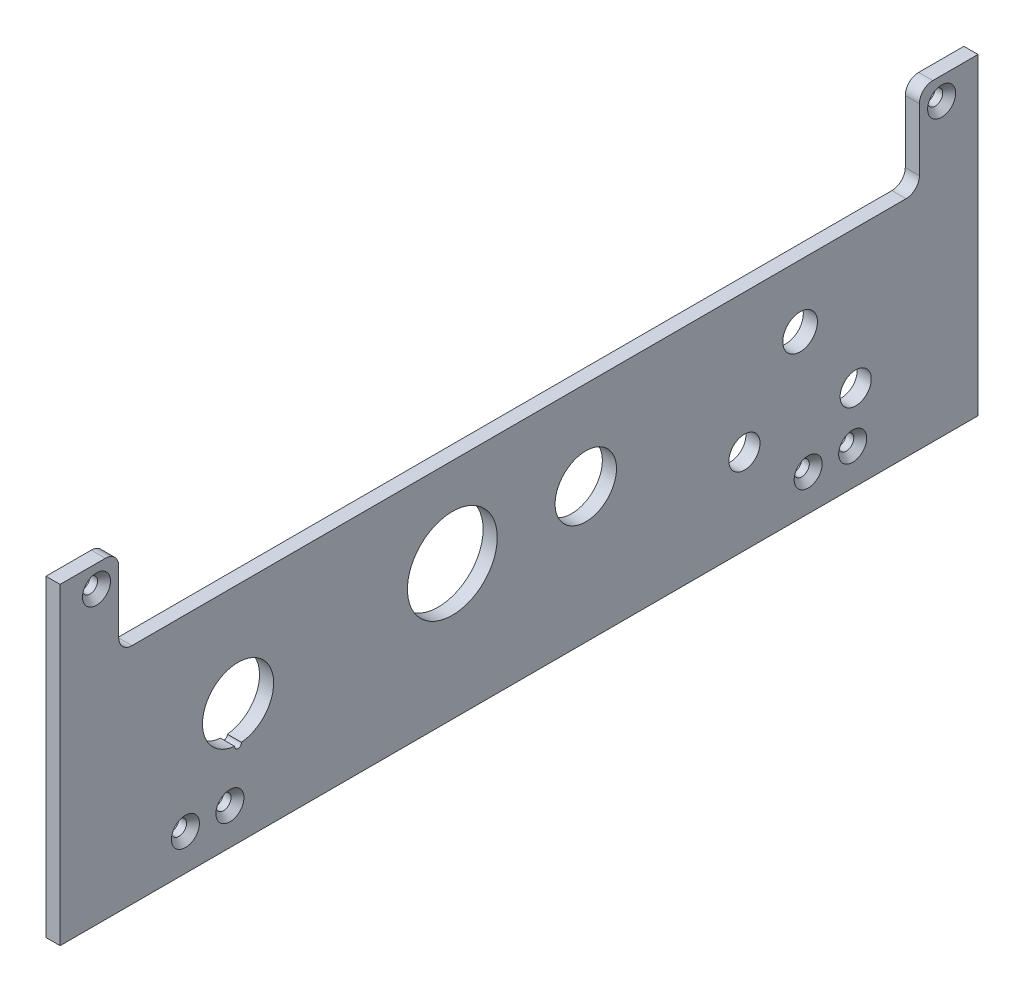
ISO-10303-21;
HEADER;
FILE_DESCRIPTION(('STEP AP214'),'2;1');
FILE_NAME('part.step','',(''),(''),'','','');
FILE_SCHEMA(('AUTOMOTIVE_DESIGN { 1 0 10303 214 1 1 1 1 }'));
ENDSEC;
DATA;
#1=APPLICATION_CONTEXT('core data for automotive mechanical design processes');
#2=APPLICATION_PROTOCOL_DEFINITION('international standard','automotive_design',2000,#1);
#3=PRODUCT_CONTEXT('',#1,'mechanical');
#4=PRODUCT('Part','Part','',(#3));
#5=PRODUCT_RELATED_PRODUCT_CATEGORY('part','',(#4));
#6=PRODUCT_DEFINITION_FORMATION('','',#4);
#7=PRODUCT_DEFINITION_CONTEXT('part definition',#1,'design');
#8=PRODUCT_DEFINITION('design','',#6,#7);
#9=PRODUCT_DEFINITION_SHAPE('','',#8);
#10=(LENGTH_UNIT() NAMED_UNIT(*) SI_UNIT(.MILLI.,.METRE.));
#11=(NAMED_UNIT(*) PLANE_ANGLE_UNIT() SI_UNIT($,.RADIAN.));
#12=(NAMED_UNIT(*) SI_UNIT($,.STERADIAN.) SOLID_ANGLE_UNIT());
#13=UNCERTAINTY_MEASURE_WITH_UNIT(LENGTH_MEASURE(1.E-05),#10,'distance_accuracy_value','');
#14=(GEOMETRIC_REPRESENTATION_CONTEXT(3) GLOBAL_UNCERTAINTY_ASSIGNED_CONTEXT((#13)) GLOBAL_UNIT_ASSIGNED_CONTEXT((#10,
#11,#12)) REPRESENTATION_CONTEXT('',''));
#15=CARTESIAN_POINT('',(0.,0.,0.));
#16=DIRECTION('',(0.,0.,1.));
#17=DIRECTION('',(1.,0.,0.));
#18=AXIS2_PLACEMENT_3D('',#15,#16,#17);
#19=CARTESIAN_POINT('',(3.175,0.,103.175));
#20=DIRECTION('',(0.,1.,0.));
#21=DIRECTION('',(0.,0.,1.));
#22=AXIS2_PLACEMENT_3D('',#19,#20,#21);
#23=PLANE('',#22);
#24=DIRECTION('',(0.,0.,-1.));
#25=VECTOR('',#24,1.);
#26=CARTESIAN_POINT('',(0.,0.,103.175));
#27=LINE('',#26,#25);
#28=CARTESIAN_POINT('',(0.,0.,103.175));
#29=VERTEX_POINT('',#28);
#30=CARTESIAN_POINT('',(0.,0.,-103.175));
#31=VERTEX_POINT('',#30);
#32=EDGE_CURVE('E239',#29,#31,#27,.T.);
#33=ORIENTED_EDGE('',*,*,#32,.T.);
#34=DIRECTION('',(-1.,0.,0.));
#35=VECTOR('',#34,1.);
#36=CARTESIAN_POINT('',(3.175,0.,-103.175));
#37=LINE('',#36,#35);
#38=CARTESIAN_POINT('',(3.175,0.,-103.175));
#39=VERTEX_POINT('',#38);
#40=EDGE_CURVE('E43',#39,#31,#37,.T.);
#41=ORIENTED_EDGE('',*,*,#40,.F.);
#42=DIRECTION('',(0.,0.,-1.));
#43=VECTOR('',#42,1.);
#44=CARTESIAN_POINT('',(3.175,0.,103.175));
#45=LINE('',#44,#43);
#46=CARTESIAN_POINT('',(3.175,0.,103.175));
#47=VERTEX_POINT('',#46);
#48=EDGE_CURVE('E243',#47,#39,#45,.T.);
#49=ORIENTED_EDGE('',*,*,#48,.F.);
#50=DIRECTION('',(-1.,0.,0.));
#51=VECTOR('',#50,1.);
#52=CARTESIAN_POINT('',(3.175,0.,103.175));
#53=LINE('',#52,#51);
#54=EDGE_CURVE('E11',#47,#29,#53,.T.);
#55=ORIENTED_EDGE('',*,*,#54,.T.);
#56=EDGE_LOOP('',(#33,#41,#49,#55));
#57=FACE_BOUND('',#56,.T.);
#58=ADVANCED_FACE('F36',(#57),#23,.F.);
#59=CARTESIAN_POINT('',(3.175,50.35,-103.175));
#60=DIRECTION('',(0.,0.,1.));
#61=DIRECTION('',(1.,0.,0.));
#62=AXIS2_PLACEMENT_3D('',#59,#60,#61);
#63=PLANE('',#62);
#64=DIRECTION('',(0.,1.,0.));
#65=VECTOR('',#64,1.);
#66=CARTESIAN_POINT('',(0.,50.35,-103.175));
#67=LINE('',#66,#65);
#68=CARTESIAN_POINT('',(0.,70.35,-103.175));
#69=VERTEX_POINT('',#68);
#70=EDGE_CURVE('E271',#31,#69,#67,.T.);
#71=ORIENTED_EDGE('',*,*,#70,.T.);
#72=DIRECTION('',(-1.,0.,0.));
#73=VECTOR('',#72,1.);
#74=CARTESIAN_POINT('',(3.175,70.35,-103.175));
#75=LINE('',#74,#73);
#76=CARTESIAN_POINT('',(3.175,70.35,-103.175));
#77=VERTEX_POINT('',#76);
#78=EDGE_CURVE('E320',#77,#69,#75,.T.);
#79=ORIENTED_EDGE('',*,*,#78,.F.);
#80=DIRECTION('',(0.,1.,0.));
#81=VECTOR('',#80,1.);
#82=CARTESIAN_POINT('',(3.175,0.,-103.175));
#83=LINE('',#82,#81);
#84=EDGE_CURVE('E246',#39,#77,#83,.T.);
#85=ORIENTED_EDGE('',*,*,#84,.F.);
#86=ORIENTED_EDGE('',*,*,#40,.T.);
#87=EDGE_LOOP('',(#71,#79,#85,#86));
#88=FACE_BOUND('',#87,.T.);
#89=ADVANCED_FACE('F326',(#88),#63,.F.);
#90=CARTESIAN_POINT('',(3.175,70.35,-103.175));
#91=DIRECTION('',(0.,-1.,0.));
#92=DIRECTION('',(0.,0.,-1.));
#93=AXIS2_PLACEMENT_3D('',#90,#91,#92);
#94=PLANE('',#93);
#95=DIRECTION('',(0.,0.,1.));
#96=VECTOR('',#95,1.);
#97=CARTESIAN_POINT('',(0.,70.35,-103.175));
#98=LINE('',#97,#96);
#99=CARTESIAN_POINT('',(0.,70.35,-93.));
#100=VERTEX_POINT('',#99);
#101=EDGE_CURVE('E273',#69,#100,#98,.T.);
#102=ORIENTED_EDGE('',*,*,#101,.T.);
#103=DIRECTION('',(-1.,0.,0.));
#104=VECTOR('',#103,1.);
#105=CARTESIAN_POINT('',(3.175,70.35,-93.));
#106=LINE('',#105,#104);
#107=CARTESIAN_POINT('',(3.175,70.35,-93.));
#108=VERTEX_POINT('',#107);
#109=EDGE_CURVE('E317',#108,#100,#106,.T.);
#110=ORIENTED_EDGE('',*,*,#109,.F.);
#111=DIRECTION('',(0.,0.,1.));
#112=VECTOR('',#111,1.);
#113=CARTESIAN_POINT('',(3.175,70.35,-103.175));
#114=LINE('',#113,#112);
#115=EDGE_CURVE('E248',#77,#108,#114,.T.);
#116=ORIENTED_EDGE('',*,*,#115,.F.);
#117=ORIENTED_EDGE('',*,*,#78,.T.);
#118=EDGE_LOOP('',(#102,#110,#116,#117));
#119=FACE_BOUND('',#118,.T.);
#120=ADVANCED_FACE('F338',(#119),#94,.F.);
#121=CARTESIAN_POINT('',(3.175,67.35,-93.));
#122=DIRECTION('',(-1.,0.,0.));
#123=DIRECTION('',(0.,0.,1.));
#124=AXIS2_PLACEMENT_3D('',#121,#122,#123);
#125=CYLINDRICAL_SURFACE('',#124,3.);
#126=CARTESIAN_POINT('',(0.,67.35,-93.));
#127=DIRECTION('',(1.,0.,0.));
#128=DIRECTION('',(0.,0.,-1.));
#129=AXIS2_PLACEMENT_3D('',#126,#127,#128);
#130=CIRCLE('',#129,3.);
#131=CARTESIAN_POINT('',(0.,67.35,-90.));
#132=VERTEX_POINT('',#131);
#133=EDGE_CURVE('E275',#100,#132,#130,.T.);
#134=ORIENTED_EDGE('',*,*,#133,.T.);
#135=DIRECTION('',(-1.,0.,0.));
#136=VECTOR('',#135,1.);
#137=CARTESIAN_POINT('',(3.175,67.35,-90.));
#138=LINE('',#137,#136);
#139=CARTESIAN_POINT('',(3.175,67.35,-90.));
#140=VERTEX_POINT('',#139);
#141=EDGE_CURVE('E314',#140,#132,#138,.T.);
#142=ORIENTED_EDGE('',*,*,#141,.F.);
#143=CARTESIAN_POINT('',(3.175,67.35,-93.));
#144=DIRECTION('',(1.,0.,0.));
#145=DIRECTION('',(0.,0.,-1.));
#146=AXIS2_PLACEMENT_3D('',#143,#144,#145);
#147=CIRCLE('',#146,3.);
#148=EDGE_CURVE('E250',#108,#140,#147,.T.);
#149=ORIENTED_EDGE('',*,*,#148,.F.);
#150=ORIENTED_EDGE('',*,*,#109,.T.);
#151=EDGE_LOOP('',(#134,#142,#149,#150));
#152=FACE_BOUND('',#151,.T.);
#153=ADVANCED_FACE('F342',(#152),#125,.T.);
#154=CARTESIAN_POINT('',(3.175,53.35,-90.));
#155=DIRECTION('',(0.,0.,-1.));
#156=DIRECTION('',(-1.,0.,0.));
#157=AXIS2_PLACEMENT_3D('',#154,#155,#156);
#158=PLANE('',#157);
#159=DIRECTION('',(0.,-1.,0.));
#160=VECTOR('',#159,1.);
#161=CARTESIAN_POINT('',(0.,53.35,-90.));
#162=LINE('',#161,#160);
#163=CARTESIAN_POINT('',(0.,53.35,-90.));
#164=VERTEX_POINT('',#163);
#165=EDGE_CURVE('E277',#132,#164,#162,.T.);
#166=ORIENTED_EDGE('',*,*,#165,.T.);
#167=DIRECTION('',(-1.,0.,0.));
#168=VECTOR('',#167,1.);
#169=CARTESIAN_POINT('',(3.175,53.35,-90.));
#170=LINE('',#169,#168);
#171=CARTESIAN_POINT('',(3.175,53.35,-90.));
#172=VERTEX_POINT('',#171);
#173=EDGE_CURVE('E311',#172,#164,#170,.T.);
#174=ORIENTED_EDGE('',*,*,#173,.F.);
#175=DIRECTION('',(0.,-1.,0.));
#176=VECTOR('',#175,1.);
#177=CARTESIAN_POINT('',(3.175,53.35,-90.));
#178=LINE('',#177,#176);
#179=EDGE_CURVE('E252',#140,#172,#178,.T.);
#180=ORIENTED_EDGE('',*,*,#179,.F.);
#181=ORIENTED_EDGE('',*,*,#141,.T.);
#182=EDGE_LOOP('',(#166,#174,#180,#181));
#183=FACE_BOUND('',#182,.T.);
#184=ADVANCED_FACE('F380',(#183),#158,.F.);
#185=CARTESIAN_POINT('',(3.175,53.35,-87.));
#186=DIRECTION('',(-1.,0.,0.));
#187=DIRECTION('',(0.,0.,1.));
#188=AXIS2_PLACEMENT_3D('',#185,#186,#187);
#189=CYLINDRICAL_SURFACE('',#188,3.);
#190=CARTESIAN_POINT('',(0.,53.35,-87.));
#191=DIRECTION('',(-1.,0.,0.));
#192=DIRECTION('',(0.,0.,-1.));
#193=AXIS2_PLACEMENT_3D('',#190,#191,#192);
#194=CIRCLE('',#193,3.);
#195=CARTESIAN_POINT('',(0.,50.35,-87.));
#196=VERTEX_POINT('',#195);
#197=EDGE_CURVE('E279',#164,#196,#194,.T.);
#198=ORIENTED_EDGE('',*,*,#197,.T.);
#199=DIRECTION('',(-1.,0.,0.));
#200=VECTOR('',#199,1.);
#201=CARTESIAN_POINT('',(3.175,50.35,-87.));
#202=LINE('',#201,#200);
#203=CARTESIAN_POINT('',(3.175,50.35,-87.));
#204=VERTEX_POINT('',#203);
#205=EDGE_CURVE('E308',#204,#196,#202,.T.);
#206=ORIENTED_EDGE('',*,*,#205,.F.);
#207=CARTESIAN_POINT('',(3.175,53.35,-87.));
#208=DIRECTION('',(-1.,0.,0.));
#209=DIRECTION('',(0.,0.,-1.));
#210=AXIS2_PLACEMENT_3D('',#207,#208,#209);
#211=CIRCLE('',#210,3.);
#212=EDGE_CURVE('E254',#172,#204,#211,.T.);
#213=ORIENTED_EDGE('',*,*,#212,.F.);
#214=ORIENTED_EDGE('',*,*,#173,.T.);
#215=EDGE_LOOP('',(#198,#206,#213,#214));
#216=FACE_BOUND('',#215,.T.);
#217=ADVANCED_FACE('F378',(#216),#189,.F.);
#218=CARTESIAN_POINT('',(3.175,50.35,87.));
#219=DIRECTION('',(0.,-1.,0.));
#220=DIRECTION('',(0.,0.,-1.));
#221=AXIS2_PLACEMENT_3D('',#218,#219,#220);
#222=PLANE('',#221);
#223=DIRECTION('',(0.,0.,1.));
#224=VECTOR('',#223,1.);
#225=CARTESIAN_POINT('',(0.,50.35,87.));
#226=LINE('',#225,#224);
#227=CARTESIAN_POINT('',(0.,50.35,87.));
#228=VERTEX_POINT('',#227);
#229=EDGE_CURVE('E281',#196,#228,#226,.T.);
#230=ORIENTED_EDGE('',*,*,#229,.T.);
#231=DIRECTION('',(-1.,0.,0.));
#232=VECTOR('',#231,1.);
#233=CARTESIAN_POINT('',(3.175,50.35,87.));
#234=LINE('',#233,#232);
#235=CARTESIAN_POINT('',(3.175,50.35,87.));
#236=VERTEX_POINT('',#235);
#237=EDGE_CURVE('E305',#236,#228,#234,.T.);
#238=ORIENTED_EDGE('',*,*,#237,.F.);
#239=DIRECTION('',(0.,0.,1.));
#240=VECTOR('',#239,1.);
#241=CARTESIAN_POINT('',(3.175,50.35,87.));
#242=LINE('',#241,#240);
#243=EDGE_CURVE('E256',#204,#236,#242,.T.);
#244=ORIENTED_EDGE('',*,*,#243,.F.);
#245=ORIENTED_EDGE('',*,*,#205,.T.);
#246=EDGE_LOOP('',(#230,#238,#244,#245));
#247=FACE_BOUND('',#246,.T.);
#248=ADVANCED_FACE('F373',(#247),#222,.F.);
#249=CARTESIAN_POINT('',(3.175,53.35,87.));
#250=DIRECTION('',(-1.,0.,0.));
#251=DIRECTION('',(0.,0.,1.));
#252=AXIS2_PLACEMENT_3D('',#249,#250,#251);
#253=CYLINDRICAL_SURFACE('',#252,3.);
#254=CARTESIAN_POINT('',(0.,53.35,87.));
#255=DIRECTION('',(-1.,0.,0.));
#256=DIRECTION('',(0.,0.,1.));
#257=AXIS2_PLACEMENT_3D('',#254,#255,#256);
#258=CIRCLE('',#257,3.);
#259=CARTESIAN_POINT('',(0.,53.35,90.));
#260=VERTEX_POINT('',#259);
#261=EDGE_CURVE('E284',#228,#260,#258,.T.);
#262=ORIENTED_EDGE('',*,*,#261,.T.);
#263=DIRECTION('',(-1.,0.,0.));
#264=VECTOR('',#263,1.);
#265=CARTESIAN_POINT('',(3.175,53.35,90.));
#266=LINE('',#265,#264);
#267=CARTESIAN_POINT('',(3.175,53.35,90.));
#268=VERTEX_POINT('',#267);
#269=EDGE_CURVE('E302',#268,#260,#266,.T.);
#270=ORIENTED_EDGE('',*,*,#269,.F.);
#271=CARTESIAN_POINT('',(3.175,53.35,87.));
#272=DIRECTION('',(-1.,0.,0.));
#273=DIRECTION('',(0.,0.,1.));
#274=AXIS2_PLACEMENT_3D('',#271,#272,#273);
#275=CIRCLE('',#274,3.);
#276=EDGE_CURVE('E259',#236,#268,#275,.T.);
#277=ORIENTED_EDGE('',*,*,#276,.F.);
#278=ORIENTED_EDGE('',*,*,#237,.T.);
#279=EDGE_LOOP('',(#262,#270,#277,#278));
#280=FACE_BOUND('',#279,.T.);
#281=ADVANCED_FACE('F368',(#280),#253,.F.);
#282=CARTESIAN_POINT('',(3.175,53.35,90.));
#283=DIRECTION('',(0.,0.,1.));
#284=DIRECTION('',(1.,0.,0.));
#285=AXIS2_PLACEMENT_3D('',#282,#283,#284);
#286=PLANE('',#285);
#287=DIRECTION('',(0.,1.,0.));
#288=VECTOR('',#287,1.);
#289=CARTESIAN_POINT('',(0.,53.35,90.));
#290=LINE('',#289,#288);
#291=CARTESIAN_POINT('',(0.,67.35,90.));
#292=VERTEX_POINT('',#291);
#293=EDGE_CURVE('E286',#260,#292,#290,.T.);
#294=ORIENTED_EDGE('',*,*,#293,.T.);
#295=DIRECTION('',(-1.,0.,0.));
#296=VECTOR('',#295,1.);
#297=CARTESIAN_POINT('',(3.175,67.35,90.));
#298=LINE('',#297,#296);
#299=CARTESIAN_POINT('',(3.175,67.35,90.));
#300=VERTEX_POINT('',#299);
#301=EDGE_CURVE('E299',#300,#292,#298,.T.);
#302=ORIENTED_EDGE('',*,*,#301,.F.);
#303=DIRECTION('',(0.,1.,0.));
#304=VECTOR('',#303,1.);
#305=CARTESIAN_POINT('',(3.175,53.35,90.));
#306=LINE('',#305,#304);
#307=EDGE_CURVE('E261',#268,#300,#306,.T.);
#308=ORIENTED_EDGE('',*,*,#307,.F.);
#309=ORIENTED_EDGE('',*,*,#269,.T.);
#310=EDGE_LOOP('',(#294,#302,#308,#309));
#311=FACE_BOUND('',#310,.T.);
#312=ADVANCED_FACE('F364',(#311),#286,.F.);
#313=CARTESIAN_POINT('',(3.175,67.35,93.));
#314=DIRECTION('',(-1.,0.,0.));
#315=DIRECTION('',(0.,0.,1.));
#316=AXIS2_PLACEMENT_3D('',#313,#314,#315);
#317=CYLINDRICAL_SURFACE('',#316,3.);
#318=CARTESIAN_POINT('',(0.,67.35,93.));
#319=DIRECTION('',(1.,0.,0.));
#320=DIRECTION('',(0.,0.,1.));
#321=AXIS2_PLACEMENT_3D('',#318,#319,#320);
#322=CIRCLE('',#321,3.);
#323=CARTESIAN_POINT('',(0.,70.35,93.));
#324=VERTEX_POINT('',#323);
#325=EDGE_CURVE('E288',#292,#324,#322,.T.);
#326=ORIENTED_EDGE('',*,*,#325,.T.);
#327=DIRECTION('',(-1.,0.,0.));
#328=VECTOR('',#327,1.);
#329=CARTESIAN_POINT('',(3.175,70.35,93.));
#330=LINE('',#329,#328);
#331=CARTESIAN_POINT('',(3.175,70.35,93.));
#332=VERTEX_POINT('',#331);
#333=EDGE_CURVE('E296',#332,#324,#330,.T.);
#334=ORIENTED_EDGE('',*,*,#333,.F.);
#335=CARTESIAN_POINT('',(3.175,67.35,93.));
#336=DIRECTION('',(1.,0.,0.));
#337=DIRECTION('',(0.,0.,1.));
#338=AXIS2_PLACEMENT_3D('',#335,#336,#337);
#339=CIRCLE('',#338,3.);
#340=EDGE_CURVE('E263',#300,#332,#339,.T.);
#341=ORIENTED_EDGE('',*,*,#340,.F.);
#342=ORIENTED_EDGE('',*,*,#301,.T.);
#343=EDGE_LOOP('',(#326,#334,#341,#342));
#344=FACE_BOUND('',#343,.T.);
#345=ADVANCED_FACE('F359',(#344),#317,.T.);
#346=CARTESIAN_POINT('',(3.175,70.35,103.175));
#347=DIRECTION('',(0.,-1.,0.));
#348=DIRECTION('',(0.,0.,-1.));
#349=AXIS2_PLACEMENT_3D('',#346,#347,#348);
#350=PLANE('',#349);
#351=DIRECTION('',(0.,0.,1.));
#352=VECTOR('',#351,1.);
#353=CARTESIAN_POINT('',(0.,70.35,103.175));
#354=LINE('',#353,#352);
#355=CARTESIAN_POINT('',(0.,70.35,103.175));
#356=VERTEX_POINT('',#355);
#357=EDGE_CURVE('E290',#324,#356,#354,.T.);
#358=ORIENTED_EDGE('',*,*,#357,.T.);
#359=DIRECTION('',(-1.,0.,0.));
#360=VECTOR('',#359,1.);
#361=CARTESIAN_POINT('',(3.175,70.35,103.175));
#362=LINE('',#361,#360);
#363=CARTESIAN_POINT('',(3.175,70.35,103.175));
#364=VERTEX_POINT('',#363);
#365=EDGE_CURVE('E268',#364,#356,#362,.T.);
#366=ORIENTED_EDGE('',*,*,#365,.F.);
#367=DIRECTION('',(0.,0.,1.));
#368=VECTOR('',#367,1.);
#369=CARTESIAN_POINT('',(3.175,70.35,103.175));
#370=LINE('',#369,#368);
#371=EDGE_CURVE('E265',#332,#364,#370,.T.);
#372=ORIENTED_EDGE('',*,*,#371,.F.);
#373=ORIENTED_EDGE('',*,*,#333,.T.);
#374=EDGE_LOOP('',(#358,#366,#372,#373));
#375=FACE_BOUND('',#374,.T.);
#376=ADVANCED_FACE('F353',(#375),#350,.F.);
#377=CARTESIAN_POINT('',(3.175,3.175,103.175));
#378=DIRECTION('',(0.,0.,-1.));
#379=DIRECTION('',(-1.,0.,0.));
#380=AXIS2_PLACEMENT_3D('',#377,#378,#379);
#381=PLANE('',#380);
#382=DIRECTION('',(0.,-1.,0.));
#383=VECTOR('',#382,1.);
#384=CARTESIAN_POINT('',(0.,3.175,103.175));
#385=LINE('',#384,#383);
#386=EDGE_CURVE('E244',#356,#29,#385,.T.);
#387=ORIENTED_EDGE('',*,*,#386,.T.);
#388=ORIENTED_EDGE('',*,*,#54,.F.);
#389=DIRECTION('',(0.,-1.,0.));
#390=VECTOR('',#389,1.);
#391=CARTESIAN_POINT('',(3.175,3.175,103.175));
#392=LINE('',#391,#390);
#393=EDGE_CURVE('E240',#364,#47,#392,.T.);
#394=ORIENTED_EDGE('',*,*,#393,.F.);
#395=ORIENTED_EDGE('',*,*,#365,.T.);
#396=EDGE_LOOP('',(#387,#388,#394,#395));
#397=FACE_BOUND('',#396,.T.);
#398=ADVANCED_FACE('F351',(#397),#381,.F.);
#399=CARTESIAN_POINT('',(3.175,67.35,-93.));
#400=DIRECTION('',(1.,0.,0.));
#401=DIRECTION('',(0.,0.,-1.));
#402=AXIS2_PLACEMENT_3D('',#399,#400,#401);
#403=PLANE('',#402);
#404=CARTESIAN_POINT('',(3.175,19.175,63.175));
#405=DIRECTION('',(1.,0.,0.));
#406=DIRECTION('',(0.,0.,-1.));
#407=AXIS2_PLACEMENT_3D('',#404,#405,#406);
#408=CIRCLE('',#407,0.774999999999999);
#409=CARTESIAN_POINT('',(3.175,19.2125390625,63.9490903169441));
#410=VERTEX_POINT('',#409);
#411=CARTESIAN_POINT('',(3.175,19.2125390625,62.4009096830559));
#412=VERTEX_POINT('',#411);
#413=EDGE_CURVE('E50',#410,#412,#408,.T.);
#414=ORIENTED_EDGE('',*,*,#413,.F.);
#415=CARTESIAN_POINT('',(3.175,27.175,63.175));
#416=DIRECTION('',(1.,0.,0.));
#417=DIRECTION('',(0.,0.,-1.));
#418=AXIS2_PLACEMENT_3D('',#415,#416,#417);
#419=CIRCLE('',#418,8.);
#420=EDGE_CURVE('E147',#412,#410,#419,.T.);
#421=ORIENTED_EDGE('',*,*,#420,.F.);
#422=EDGE_LOOP('',(#414,#421));
#423=FACE_BOUND('',#422,.T.);
#424=CARTESIAN_POINT('',(3.175,30.35,15.));
#425=DIRECTION('',(1.,0.,0.));
#426=DIRECTION('',(0.,0.,-1.));
#427=AXIS2_PLACEMENT_3D('',#424,#425,#426);
#428=CIRCLE('',#427,10.1);
#429=CARTESIAN_POINT('',(3.175,30.35,4.9));
#430=VERTEX_POINT('',#429);
#431=EDGE_CURVE('E152',#430,#430,#428,.T.);
#432=ORIENTED_EDGE('',*,*,#431,.F.);
#433=EDGE_LOOP('',(#432));
#434=FACE_BOUND('',#433,.T.);
#435=CARTESIAN_POINT('',(3.175,19.175,-75.675));
#436=DIRECTION('',(1.,0.,0.));
#437=DIRECTION('',(0.,0.,-1.));
#438=AXIS2_PLACEMENT_3D('',#435,#436,#437);
#439=CIRCLE('',#438,3.50000000000001);
#440=CARTESIAN_POINT('',(3.175,19.175,-79.175));
#441=VERTEX_POINT('',#440);
#442=EDGE_CURVE('E158',#441,#441,#439,.T.);
#443=ORIENTED_EDGE('',*,*,#442,.F.);
#444=EDGE_LOOP('',(#443));
#445=FACE_BOUND('',#444,.T.);
#446=CARTESIAN_POINT('',(3.175,19.175,-50.675));
#447=DIRECTION('',(1.,0.,0.));
#448=DIRECTION('',(0.,0.,-1.));
#449=AXIS2_PLACEMENT_3D('',#446,#447,#448);
#450=CIRCLE('',#449,3.5);
#451=CARTESIAN_POINT('',(3.175,19.175,-54.175));
#452=VERTEX_POINT('',#451);
#453=EDGE_CURVE('E165',#452,#452,#450,.T.);
#454=ORIENTED_EDGE('',*,*,#453,.F.);
#455=EDGE_LOOP('',(#454));
#456=FACE_BOUND('',#455,.T.);
#457=CARTESIAN_POINT('',(3.175,36.35,-63.175));
#458=DIRECTION('',(1.,0.,0.));
#459=DIRECTION('',(0.,0.,-1.));
#460=AXIS2_PLACEMENT_3D('',#457,#458,#459);
#461=CIRCLE('',#460,3.9);
#462=CARTESIAN_POINT('',(3.175,36.35,-67.075));
#463=VERTEX_POINT('',#462);
#464=EDGE_CURVE('E171',#463,#463,#461,.T.);
#465=ORIENTED_EDGE('',*,*,#464,.F.);
#466=EDGE_LOOP('',(#465));
#467=FACE_BOUND('',#466,.T.);
#468=CARTESIAN_POINT('',(3.175,30.35,-15.));
#469=DIRECTION('',(1.,0.,0.));
#470=DIRECTION('',(0.,0.,-1.));
#471=AXIS2_PLACEMENT_3D('',#468,#469,#470);
#472=CIRCLE('',#471,6.9);
#473=CARTESIAN_POINT('',(3.175,30.35,-21.9));
#474=VERTEX_POINT('',#473);
#475=EDGE_CURVE('E177',#474,#474,#472,.T.);
#476=ORIENTED_EDGE('',*,*,#475,.F.);
#477=EDGE_LOOP('',(#476));
#478=FACE_BOUND('',#477,.T.);
#479=CARTESIAN_POINT('',(3.175,8.175,-75.));
#480=DIRECTION('',(1.,0.,0.));
#481=DIRECTION('',(0.,0.,-1.));
#482=AXIS2_PLACEMENT_3D('',#479,#480,#481);
#483=CIRCLE('',#482,3.15);
#484=CARTESIAN_POINT('',(3.175,8.175,-78.15));
#485=VERTEX_POINT('',#484);
#486=EDGE_CURVE('E183',#485,#485,#483,.T.);
#487=ORIENTED_EDGE('',*,*,#486,.F.);
#488=EDGE_LOOP('',(#487));
#489=FACE_BOUND('',#488,.T.);
#490=CARTESIAN_POINT('',(3.175,8.175,-65.));
#491=DIRECTION('',(1.,0.,0.));
#492=DIRECTION('',(0.,0.,-1.));
#493=AXIS2_PLACEMENT_3D('',#490,#491,#492);
#494=CIRCLE('',#493,3.15);
#495=CARTESIAN_POINT('',(3.175,8.175,-68.15));
#496=VERTEX_POINT('',#495);
#497=EDGE_CURVE('E194',#496,#496,#494,.T.);
#498=ORIENTED_EDGE('',*,*,#497,.F.);
#499=EDGE_LOOP('',(#498));
#500=FACE_BOUND('',#499,.T.);
#501=CARTESIAN_POINT('',(3.175,65.35,-95.));
#502=DIRECTION('',(1.,0.,0.));
#503=DIRECTION('',(0.,0.,-1.));
#504=AXIS2_PLACEMENT_3D('',#501,#502,#503);
#505=CIRCLE('',#504,3.15);
#506=CARTESIAN_POINT('',(3.175,65.35,-98.15));
#507=VERTEX_POINT('',#506);
#508=EDGE_CURVE('E203',#507,#507,#505,.T.);
#509=ORIENTED_EDGE('',*,*,#508,.F.);
#510=EDGE_LOOP('',(#509));
#511=FACE_BOUND('',#510,.T.);
#512=CARTESIAN_POINT('',(3.175,8.175,75.));
#513=DIRECTION('',(1.,0.,0.));
#514=DIRECTION('',(0.,0.,-1.));
#515=AXIS2_PLACEMENT_3D('',#512,#513,#514);
#516=CIRCLE('',#515,3.15);
#517=CARTESIAN_POINT('',(3.175,8.175,71.85));
#518=VERTEX_POINT('',#517);
#519=EDGE_CURVE('E212',#518,#518,#516,.T.);
#520=ORIENTED_EDGE('',*,*,#519,.F.);
#521=EDGE_LOOP('',(#520));
#522=FACE_BOUND('',#521,.T.);
#523=CARTESIAN_POINT('',(3.175,8.175,65.));
#524=DIRECTION('',(1.,0.,0.));
#525=DIRECTION('',(0.,0.,-1.));
#526=AXIS2_PLACEMENT_3D('',#523,#524,#525);
#527=CIRCLE('',#526,3.15);
#528=CARTESIAN_POINT('',(3.175,8.175,61.85));
#529=VERTEX_POINT('',#528);
#530=EDGE_CURVE('E221',#529,#529,#527,.T.);
#531=ORIENTED_EDGE('',*,*,#530,.F.);
#532=EDGE_LOOP('',(#531));
#533=FACE_BOUND('',#532,.T.);
#534=CARTESIAN_POINT('',(3.175,65.35,95.));
#535=DIRECTION('',(1.,0.,0.));
#536=DIRECTION('',(0.,0.,-1.));
#537=AXIS2_PLACEMENT_3D('',#534,#535,#536);
#538=CIRCLE('',#537,3.15);
#539=CARTESIAN_POINT('',(3.175,65.35,91.85));
#540=VERTEX_POINT('',#539);
#541=EDGE_CURVE('E230',#540,#540,#538,.T.);
#542=ORIENTED_EDGE('',*,*,#541,.F.);
#543=EDGE_LOOP('',(#542));
#544=FACE_BOUND('',#543,.T.);
#545=ORIENTED_EDGE('',*,*,#393,.T.);
#546=ORIENTED_EDGE('',*,*,#48,.T.);
#547=ORIENTED_EDGE('',*,*,#84,.T.);
#548=ORIENTED_EDGE('',*,*,#115,.T.);
#549=ORIENTED_EDGE('',*,*,#148,.T.);
#550=ORIENTED_EDGE('',*,*,#179,.T.);
#551=ORIENTED_EDGE('',*,*,#212,.T.);
#552=ORIENTED_EDGE('',*,*,#243,.T.);
#553=ORIENTED_EDGE('',*,*,#276,.T.);
#554=ORIENTED_EDGE('',*,*,#307,.T.);
#555=ORIENTED_EDGE('',*,*,#340,.T.);
#556=ORIENTED_EDGE('',*,*,#371,.T.);
#557=EDGE_LOOP('',(#545,#546,#547,#548,#549,#550,#551,#552,#553,#554,#555,#556));
#558=FACE_BOUND('',#557,.T.);
#559=ADVANCED_FACE('F346',(#423,#434,#445,#456,#467,#478,#489,#500,#511,#522,#533,#544,#558),
#403,.T.);
#560=CARTESIAN_POINT('',(0.,67.35,-93.));
#561=DIRECTION('',(1.,0.,0.));
#562=DIRECTION('',(0.,0.,-1.));
#563=AXIS2_PLACEMENT_3D('',#560,#561,#562);
#564=PLANE('',#563);
#565=CARTESIAN_POINT('',(0.,27.175,63.175));
#566=DIRECTION('',(1.,0.,0.));
#567=DIRECTION('',(0.,0.,-1.));
#568=AXIS2_PLACEMENT_3D('',#565,#566,#567);
#569=CIRCLE('',#568,8.);
#570=CARTESIAN_POINT('',(0.,19.2125390625,62.4009096830559));
#571=VERTEX_POINT('',#570);
#572=CARTESIAN_POINT('',(0.,19.2125390625,63.9490903169441));
#573=VERTEX_POINT('',#572);
#574=EDGE_CURVE('E139',#571,#573,#569,.T.);
#575=ORIENTED_EDGE('',*,*,#574,.T.);
#576=CARTESIAN_POINT('',(0.,19.175,63.175));
#577=DIRECTION('',(1.,0.,0.));
#578=DIRECTION('',(0.,0.,-1.));
#579=AXIS2_PLACEMENT_3D('',#576,#577,#578);
#580=CIRCLE('',#579,0.774999999999999);
#581=EDGE_CURVE('E55',#573,#571,#580,.T.);
#582=ORIENTED_EDGE('',*,*,#581,.T.);
#583=EDGE_LOOP('',(#575,#582));
#584=FACE_BOUND('',#583,.T.);
#585=CARTESIAN_POINT('',(0.,30.35,15.));
#586=DIRECTION('',(1.,0.,0.));
#587=DIRECTION('',(0.,0.,-1.));
#588=AXIS2_PLACEMENT_3D('',#585,#586,#587);
#589=CIRCLE('',#588,10.1);
#590=CARTESIAN_POINT('',(0.,30.35,4.9));
#591=VERTEX_POINT('',#590);
#592=EDGE_CURVE('E154',#591,#591,#589,.T.);
#593=ORIENTED_EDGE('',*,*,#592,.T.);
#594=EDGE_LOOP('',(#593));
#595=FACE_BOUND('',#594,.T.);
#596=CARTESIAN_POINT('',(0.,19.175,-75.675));
#597=DIRECTION('',(1.,0.,0.));
#598=DIRECTION('',(0.,0.,-1.));
#599=AXIS2_PLACEMENT_3D('',#596,#597,#598);
#600=CIRCLE('',#599,3.50000000000001);
#601=CARTESIAN_POINT('',(0.,19.175,-79.175));
#602=VERTEX_POINT('',#601);
#603=EDGE_CURVE('E162',#602,#602,#600,.T.);
#604=ORIENTED_EDGE('',*,*,#603,.T.);
#605=EDGE_LOOP('',(#604));
#606=FACE_BOUND('',#605,.T.);
#607=CARTESIAN_POINT('',(0.,19.175,-50.675));
#608=DIRECTION('',(1.,0.,0.));
#609=DIRECTION('',(0.,0.,-1.));
#610=AXIS2_PLACEMENT_3D('',#607,#608,#609);
#611=CIRCLE('',#610,3.5);
#612=CARTESIAN_POINT('',(0.,19.175,-54.175));
#613=VERTEX_POINT('',#612);
#614=EDGE_CURVE('E168',#613,#613,#611,.T.);
#615=ORIENTED_EDGE('',*,*,#614,.T.);
#616=EDGE_LOOP('',(#615));
#617=FACE_BOUND('',#616,.T.);
#618=CARTESIAN_POINT('',(0.,36.35,-63.175));
#619=DIRECTION('',(1.,0.,0.));
#620=DIRECTION('',(0.,0.,-1.));
#621=AXIS2_PLACEMENT_3D('',#618,#619,#620);
#622=CIRCLE('',#621,3.9);
#623=CARTESIAN_POINT('',(0.,36.35,-67.075));
#624=VERTEX_POINT('',#623);
#625=EDGE_CURVE('E174',#624,#624,#622,.T.);
#626=ORIENTED_EDGE('',*,*,#625,.T.);
#627=EDGE_LOOP('',(#626));
#628=FACE_BOUND('',#627,.T.);
#629=CARTESIAN_POINT('',(0.,30.35,-15.));
#630=DIRECTION('',(1.,0.,0.));
#631=DIRECTION('',(0.,0.,-1.));
#632=AXIS2_PLACEMENT_3D('',#629,#630,#631);
#633=CIRCLE('',#632,6.9);
#634=CARTESIAN_POINT('',(0.,30.35,-21.9));
#635=VERTEX_POINT('',#634);
#636=EDGE_CURVE('E180',#635,#635,#633,.T.);
#637=ORIENTED_EDGE('',*,*,#636,.T.);
#638=EDGE_LOOP('',(#637));
#639=FACE_BOUND('',#638,.T.);
#640=CARTESIAN_POINT('',(0.,8.175,-75.));
#641=DIRECTION('',(1.,0.,0.));
#642=DIRECTION('',(0.,0.,-1.));
#643=AXIS2_PLACEMENT_3D('',#640,#641,#642);
#644=CIRCLE('',#643,1.7);
#645=CARTESIAN_POINT('',(0.,8.175,-76.7));
#646=VERTEX_POINT('',#645);
#647=EDGE_CURVE('E191',#646,#646,#644,.T.);
#648=ORIENTED_EDGE('',*,*,#647,.T.);
#649=EDGE_LOOP('',(#648));
#650=FACE_BOUND('',#649,.T.);
#651=CARTESIAN_POINT('',(0.,8.175,-65.));
#652=DIRECTION('',(1.,0.,0.));
#653=DIRECTION('',(0.,0.,-1.));
#654=AXIS2_PLACEMENT_3D('',#651,#652,#653);
#655=CIRCLE('',#654,1.7);
#656=CARTESIAN_POINT('',(0.,8.175,-66.7));
#657=VERTEX_POINT('',#656);
#658=EDGE_CURVE('E200',#657,#657,#655,.T.);
#659=ORIENTED_EDGE('',*,*,#658,.T.);
#660=EDGE_LOOP('',(#659));
#661=FACE_BOUND('',#660,.T.);
#662=CARTESIAN_POINT('',(0.,65.35,-95.));
#663=DIRECTION('',(1.,0.,0.));
#664=DIRECTION('',(0.,0.,-1.));
#665=AXIS2_PLACEMENT_3D('',#662,#663,#664);
#666=CIRCLE('',#665,1.69999999999999);
#667=CARTESIAN_POINT('',(0.,65.35,-96.7));
#668=VERTEX_POINT('',#667);
#669=EDGE_CURVE('E209',#668,#668,#666,.T.);
#670=ORIENTED_EDGE('',*,*,#669,.T.);
#671=EDGE_LOOP('',(#670));
#672=FACE_BOUND('',#671,.T.);
#673=CARTESIAN_POINT('',(0.,8.175,75.));
#674=DIRECTION('',(1.,0.,0.));
#675=DIRECTION('',(0.,0.,-1.));
#676=AXIS2_PLACEMENT_3D('',#673,#674,#675);
#677=CIRCLE('',#676,1.7);
#678=CARTESIAN_POINT('',(0.,8.175,73.3));
#679=VERTEX_POINT('',#678);
#680=EDGE_CURVE('E218',#679,#679,#677,.T.);
#681=ORIENTED_EDGE('',*,*,#680,.T.);
#682=EDGE_LOOP('',(#681));
#683=FACE_BOUND('',#682,.T.);
#684=CARTESIAN_POINT('',(0.,8.175,65.));
#685=DIRECTION('',(1.,0.,0.));
#686=DIRECTION('',(0.,0.,-1.));
#687=AXIS2_PLACEMENT_3D('',#684,#685,#686);
#688=CIRCLE('',#687,1.7);
#689=CARTESIAN_POINT('',(0.,8.175,63.3));
#690=VERTEX_POINT('',#689);
#691=EDGE_CURVE('E227',#690,#690,#688,.T.);
#692=ORIENTED_EDGE('',*,*,#691,.T.);
#693=EDGE_LOOP('',(#692));
#694=FACE_BOUND('',#693,.T.);
#695=CARTESIAN_POINT('',(0.,65.35,95.));
#696=DIRECTION('',(1.,0.,0.));
#697=DIRECTION('',(0.,0.,-1.));
#698=AXIS2_PLACEMENT_3D('',#695,#696,#697);
#699=CIRCLE('',#698,1.69999999999999);
#700=CARTESIAN_POINT('',(0.,65.35,93.3));
#701=VERTEX_POINT('',#700);
#702=EDGE_CURVE('E236',#701,#701,#699,.T.);
#703=ORIENTED_EDGE('',*,*,#702,.T.);
#704=EDGE_LOOP('',(#703));
#705=FACE_BOUND('',#704,.T.);
#706=ORIENTED_EDGE('',*,*,#32,.F.);
#707=ORIENTED_EDGE('',*,*,#386,.F.);
#708=ORIENTED_EDGE('',*,*,#357,.F.);
#709=ORIENTED_EDGE('',*,*,#325,.F.);
#710=ORIENTED_EDGE('',*,*,#293,.F.);
#711=ORIENTED_EDGE('',*,*,#261,.F.);
#712=ORIENTED_EDGE('',*,*,#229,.F.);
#713=ORIENTED_EDGE('',*,*,#197,.F.);
#714=ORIENTED_EDGE('',*,*,#165,.F.);
#715=ORIENTED_EDGE('',*,*,#133,.F.);
#716=ORIENTED_EDGE('',*,*,#101,.F.);
#717=ORIENTED_EDGE('',*,*,#70,.F.);
#718=EDGE_LOOP('',(#706,#707,#708,#709,#710,#711,#712,#713,#714,#715,#716,#717));
#719=FACE_BOUND('',#718,.T.);
#720=ADVANCED_FACE('F145',(#584,#595,#606,#617,#628,#639,#650,#661,#672,#683,#694,#705,#719),
#564,.F.);
#721=CARTESIAN_POINT('',(3.175,65.35,95.));
#722=DIRECTION('',(1.,0.,0.));
#723=DIRECTION('',(0.,0.,-1.));
#724=AXIS2_PLACEMENT_3D('',#721,#722,#723);
#725=CYLINDRICAL_SURFACE('',#724,1.69999999999999);
#726=ORIENTED_EDGE('',*,*,#702,.F.);
#727=EDGE_LOOP('',(#726));
#728=FACE_BOUND('',#727,.T.);
#729=CARTESIAN_POINT('',(1.72499999999999,65.35,95.));
#730=DIRECTION('',(1.,0.,0.));
#731=DIRECTION('',(0.,0.,-1.));
#732=AXIS2_PLACEMENT_3D('',#729,#730,#731);
#733=CIRCLE('',#732,1.69999999999999);
#734=CARTESIAN_POINT('',(1.72499999999999,65.35,93.3));
#735=VERTEX_POINT('',#734);
#736=EDGE_CURVE('E233',#735,#735,#733,.T.);
#737=ORIENTED_EDGE('',*,*,#736,.T.);
#738=EDGE_LOOP('',(#737));
#739=FACE_BOUND('',#738,.T.);
#740=ADVANCED_FACE('F470',(#728,#739),#725,.F.);
#741=CARTESIAN_POINT('',(3.175,65.35,95.));
#742=DIRECTION('',(1.,0.,0.));
#743=DIRECTION('',(0.,0.,-1.));
#744=AXIS2_PLACEMENT_3D('',#741,#742,#743);
#745=CONICAL_SURFACE('',#744,3.15,0.785398163397448);
#746=ORIENTED_EDGE('',*,*,#736,.F.);
#747=EDGE_LOOP('',(#746));
#748=FACE_BOUND('',#747,.T.);
#749=ORIENTED_EDGE('',*,*,#541,.T.);
#750=EDGE_LOOP('',(#749));
#751=FACE_BOUND('',#750,.T.);
#752=ADVANCED_FACE('F475',(#748,#751),#745,.F.);
#753=CARTESIAN_POINT('',(3.175,8.175,65.));
#754=DIRECTION('',(1.,0.,0.));
#755=DIRECTION('',(0.,0.,-1.));
#756=AXIS2_PLACEMENT_3D('',#753,#754,#755);
#757=CYLINDRICAL_SURFACE('',#756,1.69999999999999);
#758=ORIENTED_EDGE('',*,*,#691,.F.);
#759=EDGE_LOOP('',(#758));
#760=FACE_BOUND('',#759,.T.);
#761=CARTESIAN_POINT('',(1.72499999999999,8.175,65.));
#762=DIRECTION('',(1.,0.,0.));
#763=DIRECTION('',(0.,0.,-1.));
#764=AXIS2_PLACEMENT_3D('',#761,#762,#763);
#765=CIRCLE('',#764,1.69999999999999);
#766=CARTESIAN_POINT('',(1.72499999999999,8.175,63.3));
#767=VERTEX_POINT('',#766);
#768=EDGE_CURVE('E224',#767,#767,#765,.T.);
#769=ORIENTED_EDGE('',*,*,#768,.T.);
#770=EDGE_LOOP('',(#769));
#771=FACE_BOUND('',#770,.T.);
#772=ADVANCED_FACE('F487',(#760,#771),#757,.F.);
#773=CARTESIAN_POINT('',(3.175,8.175,65.));
#774=DIRECTION('',(1.,0.,0.));
#775=DIRECTION('',(0.,0.,-1.));
#776=AXIS2_PLACEMENT_3D('',#773,#774,#775);
#777=CONICAL_SURFACE('',#776,3.15,0.78539816339745);
#778=ORIENTED_EDGE('',*,*,#768,.F.);
#779=EDGE_LOOP('',(#778));
#780=FACE_BOUND('',#779,.T.);
#781=ORIENTED_EDGE('',*,*,#530,.T.);
#782=EDGE_LOOP('',(#781));
#783=FACE_BOUND('',#782,.T.);
#784=ADVANCED_FACE('F497',(#780,#783),#777,.F.);
#785=CARTESIAN_POINT('',(3.175,8.175,75.));
#786=DIRECTION('',(1.,0.,0.));
#787=DIRECTION('',(0.,0.,-1.));
#788=AXIS2_PLACEMENT_3D('',#785,#786,#787);
#789=CYLINDRICAL_SURFACE('',#788,1.69999999999999);
#790=ORIENTED_EDGE('',*,*,#680,.F.);
#791=EDGE_LOOP('',(#790));
#792=FACE_BOUND('',#791,.T.);
#793=CARTESIAN_POINT('',(1.72499999999999,8.175,75.));
#794=DIRECTION('',(1.,0.,0.));
#795=DIRECTION('',(0.,0.,-1.));
#796=AXIS2_PLACEMENT_3D('',#793,#794,#795);
#797=CIRCLE('',#796,1.69999999999999);
#798=CARTESIAN_POINT('',(1.72499999999999,8.175,73.3));
#799=VERTEX_POINT('',#798);
#800=EDGE_CURVE('E215',#799,#799,#797,.T.);
#801=ORIENTED_EDGE('',*,*,#800,.T.);
#802=EDGE_LOOP('',(#801));
#803=FACE_BOUND('',#802,.T.);
#804=ADVANCED_FACE('F507',(#792,#803),#789,.F.);
#805=CARTESIAN_POINT('',(3.175,8.175,75.));
#806=DIRECTION('',(1.,0.,0.));
#807=DIRECTION('',(0.,0.,-1.));
#808=AXIS2_PLACEMENT_3D('',#805,#806,#807);
#809=CONICAL_SURFACE('',#808,3.15,0.78539816339745);
#810=ORIENTED_EDGE('',*,*,#800,.F.);
#811=EDGE_LOOP('',(#810));
#812=FACE_BOUND('',#811,.T.);
#813=ORIENTED_EDGE('',*,*,#519,.T.);
#814=EDGE_LOOP('',(#813));
#815=FACE_BOUND('',#814,.T.);
#816=ADVANCED_FACE('F517',(#812,#815),#809,.F.);
#817=CARTESIAN_POINT('',(3.175,65.35,-95.));
#818=DIRECTION('',(1.,0.,0.));
#819=DIRECTION('',(0.,0.,-1.));
#820=AXIS2_PLACEMENT_3D('',#817,#818,#819);
#821=CYLINDRICAL_SURFACE('',#820,1.69999999999999);
#822=ORIENTED_EDGE('',*,*,#669,.F.);
#823=EDGE_LOOP('',(#822));
#824=FACE_BOUND('',#823,.T.);
#825=CARTESIAN_POINT('',(1.72499999999999,65.35,-95.));
#826=DIRECTION('',(1.,0.,0.));
#827=DIRECTION('',(0.,0.,-1.));
#828=AXIS2_PLACEMENT_3D('',#825,#826,#827);
#829=CIRCLE('',#828,1.69999999999999);
#830=CARTESIAN_POINT('',(1.72499999999999,65.35,-96.7));
#831=VERTEX_POINT('',#830);
#832=EDGE_CURVE('E206',#831,#831,#829,.T.);
#833=ORIENTED_EDGE('',*,*,#832,.T.);
#834=EDGE_LOOP('',(#833));
#835=FACE_BOUND('',#834,.T.);
#836=ADVANCED_FACE('F527',(#824,#835),#821,.F.);
#837=CARTESIAN_POINT('',(3.175,65.35,-95.));
#838=DIRECTION('',(1.,0.,0.));
#839=DIRECTION('',(0.,0.,-1.));
#840=AXIS2_PLACEMENT_3D('',#837,#838,#839);
#841=CONICAL_SURFACE('',#840,3.15,0.785398163397448);
#842=ORIENTED_EDGE('',*,*,#832,.F.);
#843=EDGE_LOOP('',(#842));
#844=FACE_BOUND('',#843,.T.);
#845=ORIENTED_EDGE('',*,*,#508,.T.);
#846=EDGE_LOOP('',(#845));
#847=FACE_BOUND('',#846,.T.);
#848=ADVANCED_FACE('F537',(#844,#847),#841,.F.);
#849=CARTESIAN_POINT('',(3.175,8.175,-65.));
#850=DIRECTION('',(1.,0.,0.));
#851=DIRECTION('',(0.,0.,-1.));
#852=AXIS2_PLACEMENT_3D('',#849,#850,#851);
#853=CYLINDRICAL_SURFACE('',#852,1.69999999999999);
#854=ORIENTED_EDGE('',*,*,#658,.F.);
#855=EDGE_LOOP('',(#854));
#856=FACE_BOUND('',#855,.T.);
#857=CARTESIAN_POINT('',(1.72499999999999,8.175,-65.));
#858=DIRECTION('',(1.,0.,0.));
#859=DIRECTION('',(0.,0.,-1.));
#860=AXIS2_PLACEMENT_3D('',#857,#858,#859);
#861=CIRCLE('',#860,1.69999999999999);
#862=CARTESIAN_POINT('',(1.72499999999999,8.175,-66.7));
#863=VERTEX_POINT('',#862);
#864=EDGE_CURVE('E197',#863,#863,#861,.T.);
#865=ORIENTED_EDGE('',*,*,#864,.T.);
#866=EDGE_LOOP('',(#865));
#867=FACE_BOUND('',#866,.T.);
#868=ADVANCED_FACE('F547',(#856,#867),#853,.F.);
#869=CARTESIAN_POINT('',(3.175,8.175,-65.));
#870=DIRECTION('',(1.,0.,0.));
#871=DIRECTION('',(0.,0.,-1.));
#872=AXIS2_PLACEMENT_3D('',#869,#870,#871);
#873=CONICAL_SURFACE('',#872,3.15,0.78539816339745);
#874=ORIENTED_EDGE('',*,*,#864,.F.);
#875=EDGE_LOOP('',(#874));
#876=FACE_BOUND('',#875,.T.);
#877=ORIENTED_EDGE('',*,*,#497,.T.);
#878=EDGE_LOOP('',(#877));
#879=FACE_BOUND('',#878,.T.);
#880=ADVANCED_FACE('F557',(#876,#879),#873,.F.);
#881=CARTESIAN_POINT('',(3.175,8.175,-75.));
#882=DIRECTION('',(1.,0.,0.));
#883=DIRECTION('',(0.,0.,-1.));
#884=AXIS2_PLACEMENT_3D('',#881,#882,#883);
#885=CYLINDRICAL_SURFACE('',#884,1.69999999999999);
#886=ORIENTED_EDGE('',*,*,#647,.F.);
#887=EDGE_LOOP('',(#886));
#888=FACE_BOUND('',#887,.T.);
#889=CARTESIAN_POINT('',(1.72499999999999,8.175,-75.));
#890=DIRECTION('',(1.,0.,0.));
#891=DIRECTION('',(0.,0.,-1.));
#892=AXIS2_PLACEMENT_3D('',#889,#890,#891);
#893=CIRCLE('',#892,1.69999999999999);
#894=CARTESIAN_POINT('',(1.72499999999999,8.175,-76.7));
#895=VERTEX_POINT('',#894);
#896=EDGE_CURVE('E188',#895,#895,#893,.T.);
#897=ORIENTED_EDGE('',*,*,#896,.T.);
#898=EDGE_LOOP('',(#897));
#899=FACE_BOUND('',#898,.T.);
#900=ADVANCED_FACE('F567',(#888,#899),#885,.F.);
#901=CARTESIAN_POINT('',(3.175,8.175,-75.));
#902=DIRECTION('',(1.,0.,0.));
#903=DIRECTION('',(0.,0.,-1.));
#904=AXIS2_PLACEMENT_3D('',#901,#902,#903);
#905=CONICAL_SURFACE('',#904,3.15,0.78539816339745);
#906=ORIENTED_EDGE('',*,*,#896,.F.);
#907=EDGE_LOOP('',(#906));
#908=FACE_BOUND('',#907,.T.);
#909=ORIENTED_EDGE('',*,*,#486,.T.);
#910=EDGE_LOOP('',(#909));
#911=FACE_BOUND('',#910,.T.);
#912=ADVANCED_FACE('F577',(#908,#911),#905,.F.);
#913=CARTESIAN_POINT('',(0.,30.35,-15.));
#914=DIRECTION('',(1.,0.,0.));
#915=DIRECTION('',(0.,0.,-1.));
#916=AXIS2_PLACEMENT_3D('',#913,#914,#915);
#917=CYLINDRICAL_SURFACE('',#916,6.9);
#918=ORIENTED_EDGE('',*,*,#636,.F.);
#919=EDGE_LOOP('',(#918));
#920=FACE_BOUND('',#919,.T.);
#921=ORIENTED_EDGE('',*,*,#475,.T.);
#922=EDGE_LOOP('',(#921));
#923=FACE_BOUND('',#922,.T.);
#924=ADVANCED_FACE('F587',(#920,#923),#917,.F.);
#925=CARTESIAN_POINT('',(0.,36.35,-63.175));
#926=DIRECTION('',(1.,0.,0.));
#927=DIRECTION('',(0.,0.,-1.));
#928=AXIS2_PLACEMENT_3D('',#925,#926,#927);
#929=CYLINDRICAL_SURFACE('',#928,3.9);
#930=ORIENTED_EDGE('',*,*,#625,.F.);
#931=EDGE_LOOP('',(#930));
#932=FACE_BOUND('',#931,.T.);
#933=ORIENTED_EDGE('',*,*,#464,.T.);
#934=EDGE_LOOP('',(#933));
#935=FACE_BOUND('',#934,.T.);
#936=ADVANCED_FACE('F610',(#932,#935),#929,.F.);
#937=CARTESIAN_POINT('',(0.,19.175,-50.675));
#938=DIRECTION('',(1.,0.,0.));
#939=DIRECTION('',(0.,0.,-1.));
#940=AXIS2_PLACEMENT_3D('',#937,#938,#939);
#941=CYLINDRICAL_SURFACE('',#940,3.5);
#942=ORIENTED_EDGE('',*,*,#614,.F.);
#943=EDGE_LOOP('',(#942));
#944=FACE_BOUND('',#943,.T.);
#945=ORIENTED_EDGE('',*,*,#453,.T.);
#946=EDGE_LOOP('',(#945));
#947=FACE_BOUND('',#946,.T.);
#948=ADVANCED_FACE('F620',(#944,#947),#941,.F.);
#949=CARTESIAN_POINT('',(0.,19.175,-75.675));
#950=DIRECTION('',(1.,0.,0.));
#951=DIRECTION('',(0.,0.,-1.));
#952=AXIS2_PLACEMENT_3D('',#949,#950,#951);
#953=CYLINDRICAL_SURFACE('',#952,3.50000000000001);
#954=ORIENTED_EDGE('',*,*,#603,.F.);
#955=EDGE_LOOP('',(#954));
#956=FACE_BOUND('',#955,.T.);
#957=ORIENTED_EDGE('',*,*,#442,.T.);
#958=EDGE_LOOP('',(#957));
#959=FACE_BOUND('',#958,.T.);
#960=ADVANCED_FACE('F630',(#956,#959),#953,.F.);
#961=CARTESIAN_POINT('',(0.,30.35,15.));
#962=DIRECTION('',(1.,0.,0.));
#963=DIRECTION('',(0.,0.,-1.));
#964=AXIS2_PLACEMENT_3D('',#961,#962,#963);
#965=CYLINDRICAL_SURFACE('',#964,10.1);
#966=ORIENTED_EDGE('',*,*,#592,.F.);
#967=EDGE_LOOP('',(#966));
#968=FACE_BOUND('',#967,.T.);
#969=ORIENTED_EDGE('',*,*,#431,.T.);
#970=EDGE_LOOP('',(#969));
#971=FACE_BOUND('',#970,.T.);
#972=ADVANCED_FACE('F640',(#968,#971),#965,.F.);
#973=CARTESIAN_POINT('',(0.,19.175,63.175));
#974=DIRECTION('',(1.,0.,0.));
#975=DIRECTION('',(0.,0.,-1.));
#976=AXIS2_PLACEMENT_3D('',#973,#974,#975);
#977=CYLINDRICAL_SURFACE('',#976,0.774999999999999);
#978=ORIENTED_EDGE('',*,*,#413,.T.);
#979=DIRECTION('',(1.,0.,0.));
#980=VECTOR('',#979,1.);
#981=CARTESIAN_POINT('',(0.,19.2125390625,62.4009096830559));
#982=LINE('',#981,#980);
#983=EDGE_CURVE('E132',#571,#412,#982,.T.);
#984=ORIENTED_EDGE('',*,*,#983,.F.);
#985=ORIENTED_EDGE('',*,*,#581,.F.);
#986=DIRECTION('',(1.,0.,0.));
#987=VECTOR('',#986,1.);
#988=CARTESIAN_POINT('',(0.,19.2125390625,63.9490903169441));
#989=LINE('',#988,#987);
#990=EDGE_CURVE('E138',#573,#410,#989,.T.);
#991=ORIENTED_EDGE('',*,*,#990,.T.);
#992=EDGE_LOOP('',(#978,#984,#985,#991));
#993=FACE_BOUND('',#992,.T.);
#994=ADVANCED_FACE('F134',(#993),#977,.F.);
#995=CARTESIAN_POINT('',(0.,27.175,63.175));
#996=DIRECTION('',(1.,0.,0.));
#997=DIRECTION('',(0.,0.,-1.));
#998=AXIS2_PLACEMENT_3D('',#995,#996,#997);
#999=CYLINDRICAL_SURFACE('',#998,8.);
#1000=ORIENTED_EDGE('',*,*,#420,.T.);
#1001=ORIENTED_EDGE('',*,*,#990,.F.);
#1002=ORIENTED_EDGE('',*,*,#574,.F.);
#1003=ORIENTED_EDGE('',*,*,#983,.T.);
#1004=EDGE_LOOP('',(#1000,#1001,#1002,#1003));
#1005=FACE_BOUND('',#1004,.T.);
#1006=ADVANCED_FACE('F142',(#1005),#999,.F.);
#1007=CLOSED_SHELL('',(#58,#89,#120,#153,#184,#217,#248,#281,#312,#345,#376,#398,#559,#720,#740,
#752,#772,#784,#804,#816,#836,#848,#868,#880,#900,#912,#924,#936,#948,#960,#972,#994,#1006));
#1008=MANIFOLD_SOLID_BREP('B2',#1007);
#1009=ADVANCED_BREP_SHAPE_REPRESENTATION('',(#18,#1008),#14);
#1010=SHAPE_DEFINITION_REPRESENTATION(#9,#1009);
ENDSEC;
END-ISO-10303-21;
